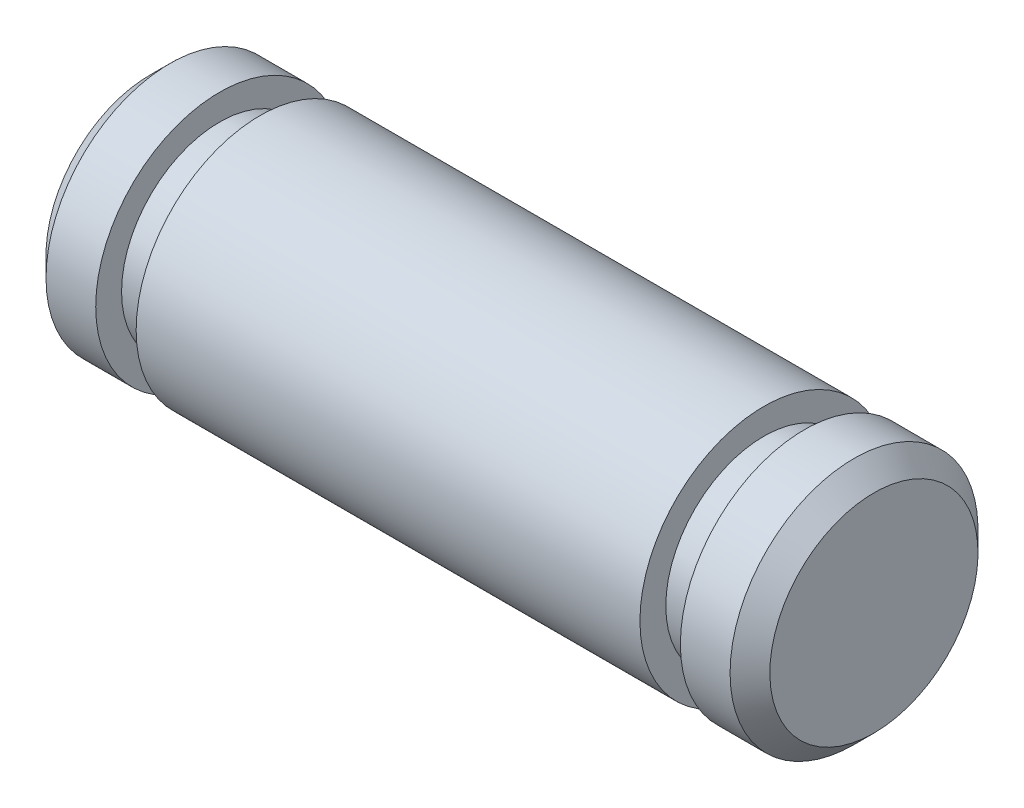
ISO-10303-21;
HEADER;
FILE_DESCRIPTION(('STEP AP214'),'2;1');
FILE_NAME('part.step','',(''),(''),'','','');
FILE_SCHEMA(('AUTOMOTIVE_DESIGN { 1 0 10303 214 1 1 1 1 }'));
ENDSEC;
DATA;
#1=APPLICATION_CONTEXT('core data for automotive mechanical design processes');
#2=APPLICATION_PROTOCOL_DEFINITION('international standard','automotive_design',2000,#1);
#3=PRODUCT_CONTEXT('',#1,'mechanical');
#4=PRODUCT('Part','Part','',(#3));
#5=PRODUCT_RELATED_PRODUCT_CATEGORY('part','',(#4));
#6=PRODUCT_DEFINITION_FORMATION('','',#4);
#7=PRODUCT_DEFINITION_CONTEXT('part definition',#1,'design');
#8=PRODUCT_DEFINITION('design','',#6,#7);
#9=PRODUCT_DEFINITION_SHAPE('','',#8);
#10=(LENGTH_UNIT() NAMED_UNIT(*) SI_UNIT(.MILLI.,.METRE.));
#11=(NAMED_UNIT(*) PLANE_ANGLE_UNIT() SI_UNIT($,.RADIAN.));
#12=(NAMED_UNIT(*) SI_UNIT($,.STERADIAN.) SOLID_ANGLE_UNIT());
#13=UNCERTAINTY_MEASURE_WITH_UNIT(LENGTH_MEASURE(1.E-05),#10,'distance_accuracy_value','');
#14=(GEOMETRIC_REPRESENTATION_CONTEXT(3) GLOBAL_UNCERTAINTY_ASSIGNED_CONTEXT((#13)) GLOBAL_UNIT_ASSIGNED_CONTEXT((#10,
#11,#12)) REPRESENTATION_CONTEXT('',''));
#15=CARTESIAN_POINT('',(0.,0.,0.));
#16=DIRECTION('',(0.,0.,1.));
#17=DIRECTION('',(1.,0.,0.));
#18=AXIS2_PLACEMENT_3D('',#15,#16,#17);
#19=CARTESIAN_POINT('',(6.9342,1.9939,0.));
#20=DIRECTION('',(-1.,0.,0.));
#21=DIRECTION('',(0.,0.,1.));
#22=AXIS2_PLACEMENT_3D('',#19,#20,#21);
#23=PLANE('',#22);
#24=CARTESIAN_POINT('',(6.93419999998923,0.,0.));
#25=DIRECTION('',(-1.,0.,0.));
#26=DIRECTION('',(0.,-1.,0.));
#27=AXIS2_PLACEMENT_3D('',#24,#25,#26);
#28=CIRCLE('',#27,1.99390000000221);
#29=CARTESIAN_POINT('',(6.93419999998923,-1.99390000000221,0.));
#30=VERTEX_POINT('',#29);
#31=EDGE_CURVE('E18',#30,#30,#28,.T.);
#32=ORIENTED_EDGE('',*,*,#31,.F.);
#33=EDGE_LOOP('',(#32));
#34=FACE_BOUND('',#33,.T.);
#35=ADVANCED_FACE('F15',(#34),#23,.F.);
#36=CARTESIAN_POINT('',(-6.9342,0.,0.));
#37=DIRECTION('',(1.,0.,0.));
#38=DIRECTION('',(0.,0.,-1.));
#39=AXIS2_PLACEMENT_3D('',#36,#37,#38);
#40=PLANE('',#39);
#41=CARTESIAN_POINT('',(-6.93419999998923,0.,0.));
#42=DIRECTION('',(1.,0.,0.));
#43=DIRECTION('',(0.,0.,-1.));
#44=AXIS2_PLACEMENT_3D('',#41,#42,#43);
#45=CIRCLE('',#44,1.99390000000221);
#46=CARTESIAN_POINT('',(-6.93419999998923,0.,-1.99390000000221));
#47=VERTEX_POINT('',#46);
#48=EDGE_CURVE('E50',#47,#47,#45,.T.);
#49=ORIENTED_EDGE('',*,*,#48,.F.);
#50=EDGE_LOOP('',(#49));
#51=FACE_BOUND('',#50,.T.);
#52=ADVANCED_FACE('F62',(#51),#40,.F.);
#53=CARTESIAN_POINT('',(6.55319999998483,0.,0.));
#54=DIRECTION('',(-1.,0.,0.));
#55=DIRECTION('',(0.,-1.,0.));
#56=AXIS2_PLACEMENT_3D('',#53,#54,#55);
#57=CONICAL_SURFACE('',#56,2.37490000000662,0.785398163397448);
#58=CARTESIAN_POINT('',(6.5532,0.,0.));
#59=DIRECTION('',(-1.,0.,0.));
#60=DIRECTION('',(0.,0.,1.));
#61=AXIS2_PLACEMENT_3D('',#58,#59,#60);
#62=CIRCLE('',#61,2.3749);
#63=CARTESIAN_POINT('',(6.5532,0.,2.3749));
#64=VERTEX_POINT('',#63);
#65=EDGE_CURVE('E52',#64,#64,#62,.T.);
#66=ORIENTED_EDGE('',*,*,#65,.F.);
#67=EDGE_LOOP('',(#66));
#68=FACE_BOUND('',#67,.T.);
#69=ORIENTED_EDGE('',*,*,#31,.T.);
#70=EDGE_LOOP('',(#69));
#71=FACE_BOUND('',#70,.T.);
#72=ADVANCED_FACE('F59',(#68,#71),#57,.T.);
#73=CARTESIAN_POINT('',(-6.55320000009851,0.,0.));
#74=DIRECTION('',(1.,0.,0.));
#75=DIRECTION('',(0.,0.,-1.));
#76=AXIS2_PLACEMENT_3D('',#73,#74,#75);
#77=CONICAL_SURFACE('',#76,2.37489999989293,0.785398163397448);
#78=ORIENTED_EDGE('',*,*,#48,.T.);
#79=EDGE_LOOP('',(#78));
#80=FACE_BOUND('',#79,.T.);
#81=CARTESIAN_POINT('',(-6.5532,0.,0.));
#82=DIRECTION('',(-1.,0.,0.));
#83=DIRECTION('',(0.,0.,1.));
#84=AXIS2_PLACEMENT_3D('',#81,#82,#83);
#85=CIRCLE('',#84,2.3749);
#86=CARTESIAN_POINT('',(-6.5532,0.,2.3749));
#87=VERTEX_POINT('',#86);
#88=EDGE_CURVE('E49',#87,#87,#85,.F.);
#89=ORIENTED_EDGE('',*,*,#88,.F.);
#90=EDGE_LOOP('',(#89));
#91=FACE_BOUND('',#90,.T.);
#92=ADVANCED_FACE('F106',(#80,#91),#77,.T.);
#93=CARTESIAN_POINT('',(6.9342,0.,0.));
#94=DIRECTION('',(-1.,0.,0.));
#95=DIRECTION('',(0.,0.,1.));
#96=AXIS2_PLACEMENT_3D('',#93,#94,#95);
#97=CYLINDRICAL_SURFACE('',#96,2.3749);
#98=CARTESIAN_POINT('',(5.6007,0.,0.));
#99=DIRECTION('',(-1.,0.,0.));
#100=DIRECTION('',(0.,0.,1.));
#101=AXIS2_PLACEMENT_3D('',#98,#99,#100);
#102=CIRCLE('',#101,2.3749);
#103=CARTESIAN_POINT('',(5.6007,0.,2.3749));
#104=VERTEX_POINT('',#103);
#105=EDGE_CURVE('E47',#104,#104,#102,.F.);
#106=ORIENTED_EDGE('',*,*,#105,.T.);
#107=EDGE_LOOP('',(#106));
#108=FACE_BOUND('',#107,.T.);
#109=ORIENTED_EDGE('',*,*,#65,.T.);
#110=EDGE_LOOP('',(#109));
#111=FACE_BOUND('',#110,.T.);
#112=ADVANCED_FACE('F102',(#108,#111),#97,.T.);
#113=CARTESIAN_POINT('',(6.9342,0.,0.));
#114=DIRECTION('',(-1.,0.,0.));
#115=DIRECTION('',(0.,0.,1.));
#116=AXIS2_PLACEMENT_3D('',#113,#114,#115);
#117=CYLINDRICAL_SURFACE('',#116,2.3749);
#118=ORIENTED_EDGE('',*,*,#88,.T.);
#119=EDGE_LOOP('',(#118));
#120=FACE_BOUND('',#119,.T.);
#121=CARTESIAN_POINT('',(-5.6007,0.,0.));
#122=DIRECTION('',(-1.,0.,0.));
#123=DIRECTION('',(0.,0.,1.));
#124=AXIS2_PLACEMENT_3D('',#121,#122,#123);
#125=CIRCLE('',#124,2.3749);
#126=CARTESIAN_POINT('',(-5.6007,0.,2.3749));
#127=VERTEX_POINT('',#126);
#128=EDGE_CURVE('E44',#127,#127,#125,.T.);
#129=ORIENTED_EDGE('',*,*,#128,.T.);
#130=EDGE_LOOP('',(#129));
#131=FACE_BOUND('',#130,.T.);
#132=ADVANCED_FACE('F98',(#120,#131),#117,.T.);
#133=CARTESIAN_POINT('',(5.6007,1.8796,0.));
#134=DIRECTION('',(1.,0.,0.));
#135=DIRECTION('',(0.,0.,-1.));
#136=AXIS2_PLACEMENT_3D('',#133,#134,#135);
#137=PLANE('',#136);
#138=CARTESIAN_POINT('',(5.6007,0.,0.));
#139=DIRECTION('',(-1.,0.,0.));
#140=DIRECTION('',(0.,0.,1.));
#141=AXIS2_PLACEMENT_3D('',#138,#139,#140);
#142=CIRCLE('',#141,1.8796);
#143=CARTESIAN_POINT('',(5.6007,0.,1.8796));
#144=VERTEX_POINT('',#143);
#145=EDGE_CURVE('E41',#144,#144,#142,.T.);
#146=ORIENTED_EDGE('',*,*,#145,.F.);
#147=EDGE_LOOP('',(#146));
#148=FACE_BOUND('',#147,.T.);
#149=ORIENTED_EDGE('',*,*,#105,.F.);
#150=EDGE_LOOP('',(#149));
#151=FACE_BOUND('',#150,.T.);
#152=ADVANCED_FACE('F94',(#148,#151),#137,.F.);
#153=CARTESIAN_POINT('',(-5.6007,2.3749,0.));
#154=DIRECTION('',(-1.,0.,0.));
#155=DIRECTION('',(0.,0.,1.));
#156=AXIS2_PLACEMENT_3D('',#153,#154,#155);
#157=PLANE('',#156);
#158=ORIENTED_EDGE('',*,*,#128,.F.);
#159=EDGE_LOOP('',(#158));
#160=FACE_BOUND('',#159,.T.);
#161=CARTESIAN_POINT('',(-5.6007,0.,0.));
#162=DIRECTION('',(-1.,0.,0.));
#163=DIRECTION('',(0.,0.,1.));
#164=AXIS2_PLACEMENT_3D('',#161,#162,#163);
#165=CIRCLE('',#164,1.8796);
#166=CARTESIAN_POINT('',(-5.6007,0.,1.8796));
#167=VERTEX_POINT('',#166);
#168=EDGE_CURVE('E38',#167,#167,#165,.F.);
#169=ORIENTED_EDGE('',*,*,#168,.F.);
#170=EDGE_LOOP('',(#169));
#171=FACE_BOUND('',#170,.T.);
#172=ADVANCED_FACE('F90',(#160,#171),#157,.F.);
#173=CARTESIAN_POINT('',(6.9342,0.,0.));
#174=DIRECTION('',(-1.,0.,0.));
#175=DIRECTION('',(0.,0.,1.));
#176=AXIS2_PLACEMENT_3D('',#173,#174,#175);
#177=CYLINDRICAL_SURFACE('',#176,1.8796);
#178=CARTESIAN_POINT('',(4.826,0.,0.));
#179=DIRECTION('',(-1.,0.,0.));
#180=DIRECTION('',(0.,0.,1.));
#181=AXIS2_PLACEMENT_3D('',#178,#179,#180);
#182=CIRCLE('',#181,1.8796);
#183=CARTESIAN_POINT('',(4.826,0.,1.8796));
#184=VERTEX_POINT('',#183);
#185=EDGE_CURVE('E35',#184,#184,#182,.F.);
#186=ORIENTED_EDGE('',*,*,#185,.T.);
#187=EDGE_LOOP('',(#186));
#188=FACE_BOUND('',#187,.T.);
#189=ORIENTED_EDGE('',*,*,#145,.T.);
#190=EDGE_LOOP('',(#189));
#191=FACE_BOUND('',#190,.T.);
#192=ADVANCED_FACE('F86',(#188,#191),#177,.T.);
#193=CARTESIAN_POINT('',(6.9342,0.,0.));
#194=DIRECTION('',(-1.,0.,0.));
#195=DIRECTION('',(0.,0.,1.));
#196=AXIS2_PLACEMENT_3D('',#193,#194,#195);
#197=CYLINDRICAL_SURFACE('',#196,1.8796);
#198=ORIENTED_EDGE('',*,*,#168,.T.);
#199=EDGE_LOOP('',(#198));
#200=FACE_BOUND('',#199,.T.);
#201=CARTESIAN_POINT('',(-4.826,0.,0.));
#202=DIRECTION('',(-1.,0.,0.));
#203=DIRECTION('',(0.,0.,1.));
#204=AXIS2_PLACEMENT_3D('',#201,#202,#203);
#205=CIRCLE('',#204,1.8796);
#206=CARTESIAN_POINT('',(-4.826,0.,1.8796));
#207=VERTEX_POINT('',#206);
#208=EDGE_CURVE('E27',#207,#207,#205,.T.);
#209=ORIENTED_EDGE('',*,*,#208,.T.);
#210=EDGE_LOOP('',(#209));
#211=FACE_BOUND('',#210,.T.);
#212=ADVANCED_FACE('F82',(#200,#211),#197,.T.);
#213=CARTESIAN_POINT('',(4.826,2.3749,0.));
#214=DIRECTION('',(-1.,0.,0.));
#215=DIRECTION('',(0.,0.,1.));
#216=AXIS2_PLACEMENT_3D('',#213,#214,#215);
#217=PLANE('',#216);
#218=CARTESIAN_POINT('',(4.826,0.,0.));
#219=DIRECTION('',(-1.,0.,0.));
#220=DIRECTION('',(0.,0.,1.));
#221=AXIS2_PLACEMENT_3D('',#218,#219,#220);
#222=CIRCLE('',#221,2.3749);
#223=CARTESIAN_POINT('',(4.826,0.,2.3749));
#224=VERTEX_POINT('',#223);
#225=EDGE_CURVE('E22',#224,#224,#222,.T.);
#226=ORIENTED_EDGE('',*,*,#225,.F.);
#227=EDGE_LOOP('',(#226));
#228=FACE_BOUND('',#227,.T.);
#229=ORIENTED_EDGE('',*,*,#185,.F.);
#230=EDGE_LOOP('',(#229));
#231=FACE_BOUND('',#230,.T.);
#232=ADVANCED_FACE('F75',(#228,#231),#217,.F.);
#233=CARTESIAN_POINT('',(-4.826,1.8796,0.));
#234=DIRECTION('',(1.,0.,0.));
#235=DIRECTION('',(0.,0.,-1.));
#236=AXIS2_PLACEMENT_3D('',#233,#234,#235);
#237=PLANE('',#236);
#238=ORIENTED_EDGE('',*,*,#208,.F.);
#239=EDGE_LOOP('',(#238));
#240=FACE_BOUND('',#239,.T.);
#241=CARTESIAN_POINT('',(-4.826,0.,0.));
#242=DIRECTION('',(-1.,0.,0.));
#243=DIRECTION('',(0.,0.,1.));
#244=AXIS2_PLACEMENT_3D('',#241,#242,#243);
#245=CIRCLE('',#244,2.3749);
#246=CARTESIAN_POINT('',(-4.826,0.,2.3749));
#247=VERTEX_POINT('',#246);
#248=EDGE_CURVE('E10',#247,#247,#245,.F.);
#249=ORIENTED_EDGE('',*,*,#248,.F.);
#250=EDGE_LOOP('',(#249));
#251=FACE_BOUND('',#250,.T.);
#252=ADVANCED_FACE('F70',(#240,#251),#237,.F.);
#253=CARTESIAN_POINT('',(6.9342,0.,0.));
#254=DIRECTION('',(-1.,0.,0.));
#255=DIRECTION('',(0.,0.,1.));
#256=AXIS2_PLACEMENT_3D('',#253,#254,#255);
#257=CYLINDRICAL_SURFACE('',#256,2.3749);
#258=ORIENTED_EDGE('',*,*,#248,.T.);
#259=EDGE_LOOP('',(#258));
#260=FACE_BOUND('',#259,.T.);
#261=ORIENTED_EDGE('',*,*,#225,.T.);
#262=EDGE_LOOP('',(#261));
#263=FACE_BOUND('',#262,.T.);
#264=ADVANCED_FACE('F68',(#260,#263),#257,.T.);
#265=CLOSED_SHELL('',(#35,#52,#72,#92,#112,#132,#152,#172,#192,#212,#232,#252,#264));
#266=MANIFOLD_SOLID_BREP('B1',#265);
#267=ADVANCED_BREP_SHAPE_REPRESENTATION('',(#18,#266),#14);
#268=SHAPE_DEFINITION_REPRESENTATION(#9,#267);
ENDSEC;
END-ISO-10303-21;
